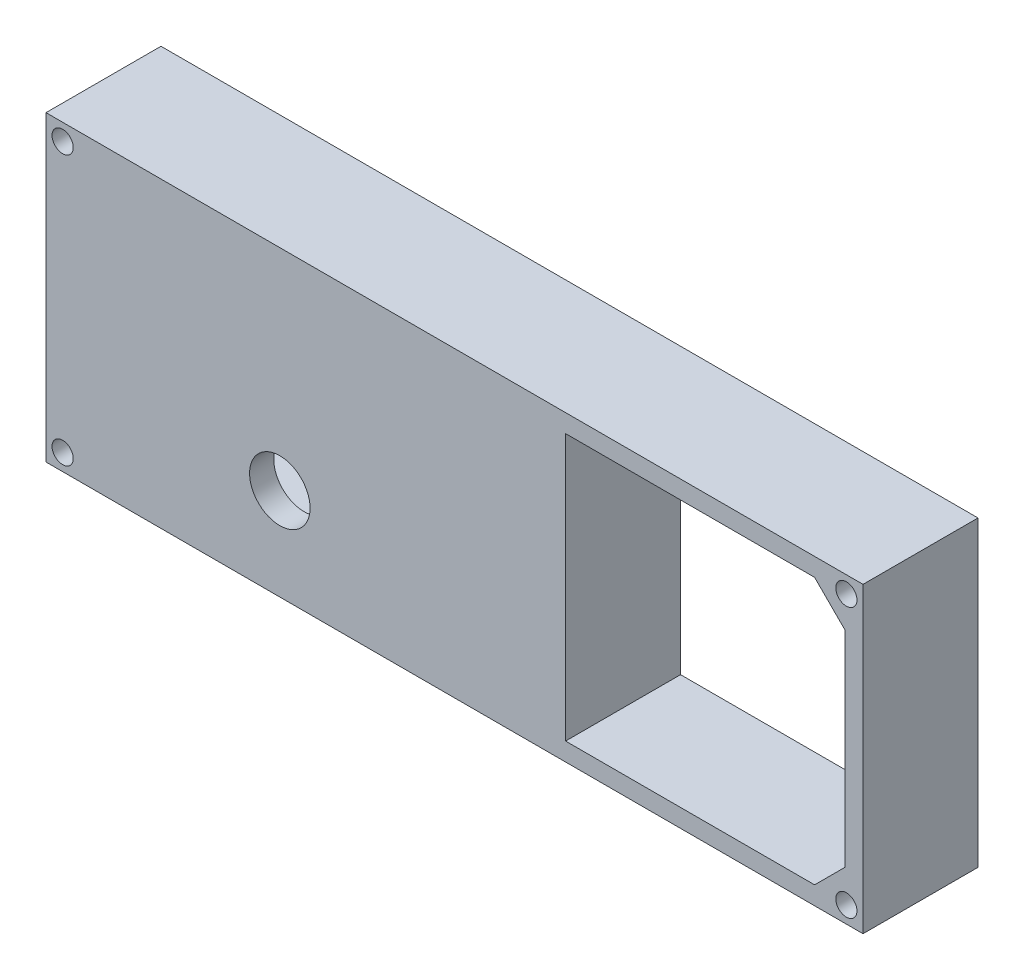
ISO-10303-21;
HEADER;
FILE_DESCRIPTION(('STEP AP214'),'2;1');
FILE_NAME('part.step','',(''),(''),'','','');
FILE_SCHEMA(('AUTOMOTIVE_DESIGN { 1 0 10303 214 1 1 1 1 }'));
ENDSEC;
DATA;
#1=APPLICATION_CONTEXT('core data for automotive mechanical design processes');
#2=APPLICATION_PROTOCOL_DEFINITION('international standard','automotive_design',2000,#1);
#3=PRODUCT_CONTEXT('',#1,'mechanical');
#4=PRODUCT('Part','Part','',(#3));
#5=PRODUCT_RELATED_PRODUCT_CATEGORY('part','',(#4));
#6=PRODUCT_DEFINITION_FORMATION('','',#4);
#7=PRODUCT_DEFINITION_CONTEXT('part definition',#1,'design');
#8=PRODUCT_DEFINITION('design','',#6,#7);
#9=PRODUCT_DEFINITION_SHAPE('','',#8);
#10=(LENGTH_UNIT() NAMED_UNIT(*) SI_UNIT(.MILLI.,.METRE.));
#11=(NAMED_UNIT(*) PLANE_ANGLE_UNIT() SI_UNIT($,.RADIAN.));
#12=(NAMED_UNIT(*) SI_UNIT($,.STERADIAN.) SOLID_ANGLE_UNIT());
#13=UNCERTAINTY_MEASURE_WITH_UNIT(LENGTH_MEASURE(1.E-05),#10,'distance_accuracy_value','');
#14=(GEOMETRIC_REPRESENTATION_CONTEXT(3) GLOBAL_UNCERTAINTY_ASSIGNED_CONTEXT((#13)) GLOBAL_UNIT_ASSIGNED_CONTEXT((#10,
#11,#12)) REPRESENTATION_CONTEXT('',''));
#15=CARTESIAN_POINT('',(0.,0.,0.));
#16=DIRECTION('',(0.,0.,1.));
#17=DIRECTION('',(1.,0.,0.));
#18=AXIS2_PLACEMENT_3D('',#15,#16,#17);
#19=CARTESIAN_POINT('',(-65.0123774263798,22.3613792313966,15.));
#20=DIRECTION('',(0.,0.,-1.));
#21=DIRECTION('',(-1.,0.,0.));
#22=AXIS2_PLACEMENT_3D('',#19,#20,#21);
#23=CYLINDRICAL_SURFACE('',#22,0.850000000000006);
#24=CARTESIAN_POINT('',(-65.0123774263798,22.3613792313966,0.));
#25=DIRECTION('',(0.,0.,1.));
#26=DIRECTION('',(1.,0.,0.));
#27=AXIS2_PLACEMENT_3D('',#24,#25,#26);
#28=CIRCLE('',#27,0.850000000000006);
#29=CARTESIAN_POINT('',(-64.1623774263798,22.3613792313966,0.));
#30=VERTEX_POINT('',#29);
#31=EDGE_CURVE('E211',#30,#30,#28,.T.);
#32=ORIENTED_EDGE('',*,*,#31,.F.);
#33=EDGE_LOOP('',(#32));
#34=FACE_BOUND('',#33,.T.);
#35=CARTESIAN_POINT('',(-65.0123774263798,22.3613792313966,7.));
#36=DIRECTION('',(0.,0.,1.));
#37=DIRECTION('',(1.,0.,0.));
#38=AXIS2_PLACEMENT_3D('',#35,#36,#37);
#39=CIRCLE('',#38,0.850000000000006);
#40=CARTESIAN_POINT('',(-64.1623774263798,22.3613792313966,7.));
#41=VERTEX_POINT('',#40);
#42=EDGE_CURVE('E37',#41,#41,#39,.T.);
#43=ORIENTED_EDGE('',*,*,#42,.T.);
#44=EDGE_LOOP('',(#43));
#45=FACE_BOUND('',#44,.T.);
#46=ADVANCED_FACE('F33',(#34,#45),#23,.F.);
#47=CARTESIAN_POINT('',(-65.0123774263798,-22.1386207686034,15.));
#48=DIRECTION('',(0.,0.,-1.));
#49=DIRECTION('',(-1.,0.,0.));
#50=AXIS2_PLACEMENT_3D('',#47,#48,#49);
#51=CYLINDRICAL_SURFACE('',#50,0.850000000000006);
#52=CARTESIAN_POINT('',(-65.0123774263798,-22.1386207686034,0.));
#53=DIRECTION('',(0.,0.,1.));
#54=DIRECTION('',(1.,0.,0.));
#55=AXIS2_PLACEMENT_3D('',#52,#53,#54);
#56=CIRCLE('',#55,0.850000000000006);
#57=CARTESIAN_POINT('',(-64.1623774263798,-22.1386207686034,0.));
#58=VERTEX_POINT('',#57);
#59=EDGE_CURVE('E208',#58,#58,#56,.T.);
#60=ORIENTED_EDGE('',*,*,#59,.F.);
#61=EDGE_LOOP('',(#60));
#62=FACE_BOUND('',#61,.T.);
#63=CARTESIAN_POINT('',(-65.0123774263798,-22.1386207686034,7.));
#64=DIRECTION('',(0.,0.,1.));
#65=DIRECTION('',(1.,0.,0.));
#66=AXIS2_PLACEMENT_3D('',#63,#64,#65);
#67=CIRCLE('',#66,0.850000000000006);
#68=CARTESIAN_POINT('',(-64.1623774263798,-22.1386207686034,7.));
#69=VERTEX_POINT('',#68);
#70=EDGE_CURVE('E305',#69,#69,#67,.T.);
#71=ORIENTED_EDGE('',*,*,#70,.T.);
#72=EDGE_LOOP('',(#71));
#73=FACE_BOUND('',#72,.T.);
#74=ADVANCED_FACE('F384',(#62,#73),#51,.F.);
#75=CARTESIAN_POINT('',(64.4876225736202,-22.1386207686034,15.));
#76=DIRECTION('',(0.,0.,-1.));
#77=DIRECTION('',(-1.,0.,0.));
#78=AXIS2_PLACEMENT_3D('',#75,#76,#77);
#79=CYLINDRICAL_SURFACE('',#78,0.850000000000006);
#80=CARTESIAN_POINT('',(64.4876225736202,-22.1386207686034,0.));
#81=DIRECTION('',(0.,0.,1.));
#82=DIRECTION('',(1.,0.,0.));
#83=AXIS2_PLACEMENT_3D('',#80,#81,#82);
#84=CIRCLE('',#83,0.850000000000006);
#85=CARTESIAN_POINT('',(65.3376225736202,-22.1386207686034,0.));
#86=VERTEX_POINT('',#85);
#87=EDGE_CURVE('E205',#86,#86,#84,.T.);
#88=ORIENTED_EDGE('',*,*,#87,.F.);
#89=EDGE_LOOP('',(#88));
#90=FACE_BOUND('',#89,.T.);
#91=CARTESIAN_POINT('',(64.4876225736202,-22.1386207686034,7.));
#92=DIRECTION('',(0.,0.,1.));
#93=DIRECTION('',(1.,0.,0.));
#94=AXIS2_PLACEMENT_3D('',#91,#92,#93);
#95=CIRCLE('',#94,0.850000000000006);
#96=CARTESIAN_POINT('',(65.3376225736202,-22.1386207686034,7.));
#97=VERTEX_POINT('',#96);
#98=EDGE_CURVE('E302',#97,#97,#95,.T.);
#99=ORIENTED_EDGE('',*,*,#98,.T.);
#100=EDGE_LOOP('',(#99));
#101=FACE_BOUND('',#100,.T.);
#102=ADVANCED_FACE('F390',(#90,#101),#79,.F.);
#103=CARTESIAN_POINT('',(64.4876225736202,22.3613792313966,15.));
#104=DIRECTION('',(0.,0.,-1.));
#105=DIRECTION('',(-1.,0.,0.));
#106=AXIS2_PLACEMENT_3D('',#103,#104,#105);
#107=CYLINDRICAL_SURFACE('',#106,0.850000000000006);
#108=CARTESIAN_POINT('',(64.4876225736202,22.3613792313966,0.));
#109=DIRECTION('',(0.,0.,1.));
#110=DIRECTION('',(1.,0.,0.));
#111=AXIS2_PLACEMENT_3D('',#108,#109,#110);
#112=CIRCLE('',#111,0.850000000000006);
#113=CARTESIAN_POINT('',(65.3376225736202,22.3613792313966,0.));
#114=VERTEX_POINT('',#113);
#115=EDGE_CURVE('E202',#114,#114,#112,.T.);
#116=ORIENTED_EDGE('',*,*,#115,.F.);
#117=EDGE_LOOP('',(#116));
#118=FACE_BOUND('',#117,.T.);
#119=CARTESIAN_POINT('',(64.4876225736202,22.3613792313966,7.));
#120=DIRECTION('',(0.,0.,1.));
#121=DIRECTION('',(1.,0.,0.));
#122=AXIS2_PLACEMENT_3D('',#119,#120,#121);
#123=CIRCLE('',#122,0.850000000000006);
#124=CARTESIAN_POINT('',(65.3376225736202,22.3613792313966,7.));
#125=VERTEX_POINT('',#124);
#126=EDGE_CURVE('E299',#125,#125,#123,.T.);
#127=ORIENTED_EDGE('',*,*,#126,.T.);
#128=EDGE_LOOP('',(#127));
#129=FACE_BOUND('',#128,.T.);
#130=ADVANCED_FACE('F442',(#118,#129),#107,.F.);
#131=CARTESIAN_POINT('',(0.,0.,0.));
#132=DIRECTION('',(0.,0.,1.));
#133=DIRECTION('',(1.,0.,0.));
#134=AXIS2_PLACEMENT_3D('',#131,#132,#133);
#135=PLANE('',#134);
#136=DIRECTION('',(0.707106781186547,-0.707106781186548,0.));
#137=VECTOR('',#136,1.);
#138=CARTESIAN_POINT('',(-64.7623774263798,-16.8886207686034,0.));
#139=LINE('',#138,#137);
#140=CARTESIAN_POINT('',(-64.7623774263798,-16.8886207686034,0.));
#141=VERTEX_POINT('',#140);
#142=CARTESIAN_POINT('',(-59.7623774263798,-21.8886207686034,0.));
#143=VERTEX_POINT('',#142);
#144=EDGE_CURVE('E58',#141,#143,#139,.T.);
#145=ORIENTED_EDGE('',*,*,#144,.T.);
#146=DIRECTION('',(1.,0.,0.));
#147=VECTOR('',#146,1.);
#148=CARTESIAN_POINT('',(-59.7623774263798,-21.8886207686034,0.));
#149=LINE('',#148,#147);
#150=CARTESIAN_POINT('',(15.0892665911631,-21.8886207686034,0.));
#151=VERTEX_POINT('',#150);
#152=EDGE_CURVE('E257',#143,#151,#149,.T.);
#153=ORIENTED_EDGE('',*,*,#152,.T.);
#154=DIRECTION('',(0.,1.,0.));
#155=VECTOR('',#154,1.);
#156=CARTESIAN_POINT('',(15.0892665911631,22.1113792313966,0.));
#157=LINE('',#156,#155);
#158=CARTESIAN_POINT('',(15.0892665911631,22.1113792313966,0.));
#159=VERTEX_POINT('',#158);
#160=EDGE_CURVE('E260',#151,#159,#157,.T.);
#161=ORIENTED_EDGE('',*,*,#160,.T.);
#162=DIRECTION('',(-1.,0.,0.));
#163=VECTOR('',#162,1.);
#164=CARTESIAN_POINT('',(-59.7623774263798,22.1113792313966,0.));
#165=LINE('',#164,#163);
#166=CARTESIAN_POINT('',(-59.7623774263798,22.1113792313966,0.));
#167=VERTEX_POINT('',#166);
#168=EDGE_CURVE('E263',#159,#167,#165,.T.);
#169=ORIENTED_EDGE('',*,*,#168,.T.);
#170=DIRECTION('',(-0.707106781186547,-0.707106781186548,0.));
#171=VECTOR('',#170,1.);
#172=CARTESIAN_POINT('',(-59.7623774263798,22.1113792313966,0.));
#173=LINE('',#172,#171);
#174=CARTESIAN_POINT('',(-64.7623774263798,17.1113792313966,0.));
#175=VERTEX_POINT('',#174);
#176=EDGE_CURVE('E266',#167,#175,#173,.T.);
#177=ORIENTED_EDGE('',*,*,#176,.T.);
#178=DIRECTION('',(0.,-1.,0.));
#179=VECTOR('',#178,1.);
#180=CARTESIAN_POINT('',(-64.7623774263798,17.1113792313966,0.));
#181=LINE('',#180,#179);
#182=EDGE_CURVE('E240',#175,#141,#181,.T.);
#183=ORIENTED_EDGE('',*,*,#182,.T.);
#184=EDGE_LOOP('',(#145,#153,#161,#169,#177,#183));
#185=FACE_BOUND('',#184,.T.);
#186=DIRECTION('',(-1.,0.,0.));
#187=VECTOR('',#186,1.);
#188=CARTESIAN_POINT('',(67.2376225736202,25.1113792313966,0.));
#189=LINE('',#188,#187);
#190=CARTESIAN_POINT('',(67.2376225736202,25.1113792313966,0.));
#191=VERTEX_POINT('',#190);
#192=CARTESIAN_POINT('',(-67.7623774263798,25.1113792313966,0.));
#193=VERTEX_POINT('',#192);
#194=EDGE_CURVE('E282',#191,#193,#189,.T.);
#195=ORIENTED_EDGE('',*,*,#194,.F.);
#196=DIRECTION('',(0.,1.,0.));
#197=VECTOR('',#196,1.);
#198=CARTESIAN_POINT('',(67.2376225736202,-24.8886207686034,0.));
#199=LINE('',#198,#197);
#200=CARTESIAN_POINT('',(67.2376225736202,-24.8886207686034,0.));
#201=VERTEX_POINT('',#200);
#202=EDGE_CURVE('E289',#201,#191,#199,.T.);
#203=ORIENTED_EDGE('',*,*,#202,.F.);
#204=DIRECTION('',(1.,0.,0.));
#205=VECTOR('',#204,1.);
#206=CARTESIAN_POINT('',(-67.7623774263798,-24.8886207686034,0.));
#207=LINE('',#206,#205);
#208=CARTESIAN_POINT('',(-67.7623774263798,-24.8886207686034,0.));
#209=VERTEX_POINT('',#208);
#210=EDGE_CURVE('E287',#209,#201,#207,.T.);
#211=ORIENTED_EDGE('',*,*,#210,.F.);
#212=DIRECTION('',(0.,-1.,0.));
#213=VECTOR('',#212,1.);
#214=CARTESIAN_POINT('',(-67.7623774263798,25.1113792313966,0.));
#215=LINE('',#214,#213);
#216=EDGE_CURVE('E285',#193,#209,#215,.T.);
#217=ORIENTED_EDGE('',*,*,#216,.F.);
#218=EDGE_LOOP('',(#195,#203,#211,#217));
#219=FACE_BOUND('',#218,.T.);
#220=DIRECTION('',(-1.,0.,0.));
#221=VECTOR('',#220,1.);
#222=CARTESIAN_POINT('',(59.2376225736202,22.1113792313966,0.));
#223=LINE('',#222,#221);
#224=CARTESIAN_POINT('',(59.2376225736202,22.1113792313966,0.));
#225=VERTEX_POINT('',#224);
#226=CARTESIAN_POINT('',(18.0892665911631,22.1113792313966,0.));
#227=VERTEX_POINT('',#226);
#228=EDGE_CURVE('E50',#225,#227,#223,.T.);
#229=ORIENTED_EDGE('',*,*,#228,.T.);
#230=DIRECTION('',(0.,-1.,0.));
#231=VECTOR('',#230,1.);
#232=CARTESIAN_POINT('',(18.0892665911631,22.1113792313966,0.));
#233=LINE('',#232,#231);
#234=CARTESIAN_POINT('',(18.0892665911631,-21.8886207686034,0.));
#235=VERTEX_POINT('',#234);
#236=EDGE_CURVE('E157',#227,#235,#233,.T.);
#237=ORIENTED_EDGE('',*,*,#236,.T.);
#238=DIRECTION('',(1.,0.,0.));
#239=VECTOR('',#238,1.);
#240=CARTESIAN_POINT('',(18.0892665911631,-21.8886207686034,0.));
#241=LINE('',#240,#239);
#242=CARTESIAN_POINT('',(59.2376225736202,-21.8886207686034,0.));
#243=VERTEX_POINT('',#242);
#244=EDGE_CURVE('E216',#235,#243,#241,.T.);
#245=ORIENTED_EDGE('',*,*,#244,.T.);
#246=DIRECTION('',(0.707106781186547,0.707106781186548,0.));
#247=VECTOR('',#246,1.);
#248=CARTESIAN_POINT('',(59.2376225736202,-21.8886207686034,0.));
#249=LINE('',#248,#247);
#250=CARTESIAN_POINT('',(64.2376225736202,-16.8886207686034,0.));
#251=VERTEX_POINT('',#250);
#252=EDGE_CURVE('E219',#243,#251,#249,.T.);
#253=ORIENTED_EDGE('',*,*,#252,.T.);
#254=DIRECTION('',(0.,1.,0.));
#255=VECTOR('',#254,1.);
#256=CARTESIAN_POINT('',(64.2376225736202,-16.8886207686034,0.));
#257=LINE('',#256,#255);
#258=CARTESIAN_POINT('',(64.2376225736202,17.1113792313966,0.));
#259=VERTEX_POINT('',#258);
#260=EDGE_CURVE('E222',#251,#259,#257,.T.);
#261=ORIENTED_EDGE('',*,*,#260,.T.);
#262=DIRECTION('',(-0.707106781186547,0.707106781186548,0.));
#263=VECTOR('',#262,1.);
#264=CARTESIAN_POINT('',(64.2376225736202,17.1113792313966,0.));
#265=LINE('',#264,#263);
#266=EDGE_CURVE('E225',#259,#225,#265,.T.);
#267=ORIENTED_EDGE('',*,*,#266,.T.);
#268=EDGE_LOOP('',(#229,#237,#245,#253,#261,#267));
#269=FACE_BOUND('',#268,.T.);
#270=ORIENTED_EDGE('',*,*,#31,.T.);
#271=EDGE_LOOP('',(#270));
#272=FACE_BOUND('',#271,.T.);
#273=ORIENTED_EDGE('',*,*,#59,.T.);
#274=EDGE_LOOP('',(#273));
#275=FACE_BOUND('',#274,.T.);
#276=ORIENTED_EDGE('',*,*,#87,.T.);
#277=EDGE_LOOP('',(#276));
#278=FACE_BOUND('',#277,.T.);
#279=ORIENTED_EDGE('',*,*,#115,.T.);
#280=EDGE_LOOP('',(#279));
#281=FACE_BOUND('',#280,.T.);
#282=ADVANCED_FACE('F439',(#185,#219,#269,#272,#275,#278,#281),#135,.F.);
#283=CARTESIAN_POINT('',(67.2376225736202,25.1113792313966,15.));
#284=DIRECTION('',(0.,-1.,0.));
#285=DIRECTION('',(0.,0.,-1.));
#286=AXIS2_PLACEMENT_3D('',#283,#284,#285);
#287=PLANE('',#286);
#288=ORIENTED_EDGE('',*,*,#194,.T.);
#289=DIRECTION('',(0.,0.,-1.));
#290=VECTOR('',#289,1.);
#291=CARTESIAN_POINT('',(-67.7623774263798,25.1113792313966,15.));
#292=LINE('',#291,#290);
#293=CARTESIAN_POINT('',(-67.7623774263798,25.1113792313966,19.));
#294=VERTEX_POINT('',#293);
#295=EDGE_CURVE('E11',#294,#193,#292,.T.);
#296=ORIENTED_EDGE('',*,*,#295,.F.);
#297=DIRECTION('',(-1.,0.,0.));
#298=VECTOR('',#297,1.);
#299=CARTESIAN_POINT('',(-67.7623774263798,25.1113792313966,19.));
#300=LINE('',#299,#298);
#301=CARTESIAN_POINT('',(67.2376225736202,25.1113792313966,19.));
#302=VERTEX_POINT('',#301);
#303=EDGE_CURVE('E199',#302,#294,#300,.T.);
#304=ORIENTED_EDGE('',*,*,#303,.F.);
#305=DIRECTION('',(0.,0.,-1.));
#306=VECTOR('',#305,1.);
#307=CARTESIAN_POINT('',(67.2376225736202,25.1113792313966,15.));
#308=LINE('',#307,#306);
#309=EDGE_CURVE('E291',#302,#191,#308,.T.);
#310=ORIENTED_EDGE('',*,*,#309,.T.);
#311=EDGE_LOOP('',(#288,#296,#304,#310));
#312=FACE_BOUND('',#311,.T.);
#313=ADVANCED_FACE('F35',(#312),#287,.F.);
#314=CARTESIAN_POINT('',(-67.7623774263798,25.1113792313966,15.));
#315=DIRECTION('',(1.,0.,0.));
#316=DIRECTION('',(0.,0.,-1.));
#317=AXIS2_PLACEMENT_3D('',#314,#315,#316);
#318=PLANE('',#317);
#319=ORIENTED_EDGE('',*,*,#216,.T.);
#320=DIRECTION('',(0.,0.,-1.));
#321=VECTOR('',#320,1.);
#322=CARTESIAN_POINT('',(-67.7623774263798,-24.8886207686034,15.));
#323=LINE('',#322,#321);
#324=CARTESIAN_POINT('',(-67.7623774263798,-24.8886207686034,19.));
#325=VERTEX_POINT('',#324);
#326=EDGE_CURVE('E42',#325,#209,#323,.T.);
#327=ORIENTED_EDGE('',*,*,#326,.F.);
#328=DIRECTION('',(0.,-1.,0.));
#329=VECTOR('',#328,1.);
#330=CARTESIAN_POINT('',(-67.7623774263798,25.1113792313966,19.));
#331=LINE('',#330,#329);
#332=EDGE_CURVE('E188',#294,#325,#331,.T.);
#333=ORIENTED_EDGE('',*,*,#332,.F.);
#334=ORIENTED_EDGE('',*,*,#295,.T.);
#335=EDGE_LOOP('',(#319,#327,#333,#334));
#336=FACE_BOUND('',#335,.T.);
#337=ADVANCED_FACE('F449',(#336),#318,.F.);
#338=CARTESIAN_POINT('',(-67.7623774263798,-24.8886207686034,15.));
#339=DIRECTION('',(0.,1.,0.));
#340=DIRECTION('',(0.,0.,1.));
#341=AXIS2_PLACEMENT_3D('',#338,#339,#340);
#342=PLANE('',#341);
#343=ORIENTED_EDGE('',*,*,#210,.T.);
#344=DIRECTION('',(0.,0.,-1.));
#345=VECTOR('',#344,1.);
#346=CARTESIAN_POINT('',(67.2376225736202,-24.8886207686034,15.));
#347=LINE('',#346,#345);
#348=CARTESIAN_POINT('',(67.2376225736202,-24.8886207686034,19.));
#349=VERTEX_POINT('',#348);
#350=EDGE_CURVE('E294',#349,#201,#347,.T.);
#351=ORIENTED_EDGE('',*,*,#350,.F.);
#352=DIRECTION('',(1.,0.,0.));
#353=VECTOR('',#352,1.);
#354=CARTESIAN_POINT('',(-67.7623774263798,-24.8886207686034,19.));
#355=LINE('',#354,#353);
#356=EDGE_CURVE('E193',#325,#349,#355,.T.);
#357=ORIENTED_EDGE('',*,*,#356,.F.);
#358=ORIENTED_EDGE('',*,*,#326,.T.);
#359=EDGE_LOOP('',(#343,#351,#357,#358));
#360=FACE_BOUND('',#359,.T.);
#361=ADVANCED_FACE('F446',(#360),#342,.F.);
#362=CARTESIAN_POINT('',(67.2376225736202,-24.8886207686034,15.));
#363=DIRECTION('',(-1.,0.,0.));
#364=DIRECTION('',(0.,0.,1.));
#365=AXIS2_PLACEMENT_3D('',#362,#363,#364);
#366=PLANE('',#365);
#367=ORIENTED_EDGE('',*,*,#202,.T.);
#368=ORIENTED_EDGE('',*,*,#309,.F.);
#369=DIRECTION('',(0.,1.,0.));
#370=VECTOR('',#369,1.);
#371=CARTESIAN_POINT('',(67.2376225736202,25.1113792313966,19.));
#372=LINE('',#371,#370);
#373=EDGE_CURVE('E196',#349,#302,#372,.T.);
#374=ORIENTED_EDGE('',*,*,#373,.F.);
#375=ORIENTED_EDGE('',*,*,#350,.T.);
#376=EDGE_LOOP('',(#367,#368,#374,#375));
#377=FACE_BOUND('',#376,.T.);
#378=ADVANCED_FACE('F438',(#377),#366,.F.);
#379=CARTESIAN_POINT('',(-64.7623774263798,-16.8886207686034,15.));
#380=DIRECTION('',(0.707106781186548,0.707106781186547,0.));
#381=DIRECTION('',(-0.707106781186547,0.707106781186548,0.));
#382=AXIS2_PLACEMENT_3D('',#379,#380,#381);
#383=PLANE('',#382);
#384=ORIENTED_EDGE('',*,*,#144,.F.);
#385=DIRECTION('',(0.,0.,-1.));
#386=VECTOR('',#385,1.);
#387=CARTESIAN_POINT('',(-64.7623774263798,-16.8886207686034,15.));
#388=LINE('',#387,#386);
#389=CARTESIAN_POINT('',(-64.7623774263798,-16.8886207686034,15.));
#390=VERTEX_POINT('',#389);
#391=EDGE_CURVE('E255',#390,#141,#388,.T.);
#392=ORIENTED_EDGE('',*,*,#391,.F.);
#393=DIRECTION('',(0.707106781186547,-0.707106781186548,0.));
#394=VECTOR('',#393,1.);
#395=CARTESIAN_POINT('',(-64.7623774263798,-16.8886207686034,15.));
#396=LINE('',#395,#394);
#397=CARTESIAN_POINT('',(-59.7623774263798,-21.8886207686034,15.));
#398=VERTEX_POINT('',#397);
#399=EDGE_CURVE('E236',#390,#398,#396,.T.);
#400=ORIENTED_EDGE('',*,*,#399,.T.);
#401=DIRECTION('',(0.,0.,-1.));
#402=VECTOR('',#401,1.);
#403=CARTESIAN_POINT('',(-59.7623774263798,-21.8886207686034,15.));
#404=LINE('',#403,#402);
#405=EDGE_CURVE('E280',#398,#143,#404,.T.);
#406=ORIENTED_EDGE('',*,*,#405,.T.);
#407=EDGE_LOOP('',(#384,#392,#400,#406));
#408=FACE_BOUND('',#407,.T.);
#409=ADVANCED_FACE('F434',(#408),#383,.T.);
#410=CARTESIAN_POINT('',(-59.7623774263798,-21.8886207686034,15.));
#411=DIRECTION('',(0.,1.,0.));
#412=DIRECTION('',(-1.,0.,0.));
#413=AXIS2_PLACEMENT_3D('',#410,#411,#412);
#414=PLANE('',#413);
#415=ORIENTED_EDGE('',*,*,#152,.F.);
#416=ORIENTED_EDGE('',*,*,#405,.F.);
#417=DIRECTION('',(1.,0.,0.));
#418=VECTOR('',#417,1.);
#419=CARTESIAN_POINT('',(-59.7623774263798,-21.8886207686034,15.));
#420=LINE('',#419,#418);
#421=CARTESIAN_POINT('',(15.0892665911631,-21.8886207686034,15.));
#422=VERTEX_POINT('',#421);
#423=EDGE_CURVE('E239',#398,#422,#420,.T.);
#424=ORIENTED_EDGE('',*,*,#423,.T.);
#425=DIRECTION('',(0.,0.,-1.));
#426=VECTOR('',#425,1.);
#427=CARTESIAN_POINT('',(15.0892665911631,-21.8886207686034,15.));
#428=LINE('',#427,#426);
#429=EDGE_CURVE('E278',#422,#151,#428,.T.);
#430=ORIENTED_EDGE('',*,*,#429,.T.);
#431=EDGE_LOOP('',(#415,#416,#424,#430));
#432=FACE_BOUND('',#431,.T.);
#433=ADVANCED_FACE('F430',(#432),#414,.T.);
#434=CARTESIAN_POINT('',(15.0892665911631,22.1113792313966,15.));
#435=DIRECTION('',(-1.,0.,0.));
#436=DIRECTION('',(0.,-1.,0.));
#437=AXIS2_PLACEMENT_3D('',#434,#435,#436);
#438=PLANE('',#437);
#439=ORIENTED_EDGE('',*,*,#160,.F.);
#440=ORIENTED_EDGE('',*,*,#429,.F.);
#441=DIRECTION('',(0.,1.,0.));
#442=VECTOR('',#441,1.);
#443=CARTESIAN_POINT('',(15.0892665911631,22.1113792313966,15.));
#444=LINE('',#443,#442);
#445=CARTESIAN_POINT('',(15.0892665911631,22.1113792313966,15.));
#446=VERTEX_POINT('',#445);
#447=EDGE_CURVE('E243',#422,#446,#444,.T.);
#448=ORIENTED_EDGE('',*,*,#447,.T.);
#449=DIRECTION('',(0.,0.,-1.));
#450=VECTOR('',#449,1.);
#451=CARTESIAN_POINT('',(15.0892665911631,22.1113792313966,15.));
#452=LINE('',#451,#450);
#453=EDGE_CURVE('E276',#446,#159,#452,.T.);
#454=ORIENTED_EDGE('',*,*,#453,.T.);
#455=EDGE_LOOP('',(#439,#440,#448,#454));
#456=FACE_BOUND('',#455,.T.);
#457=ADVANCED_FACE('F426',(#456),#438,.T.);
#458=CARTESIAN_POINT('',(-59.7623774263798,22.1113792313966,15.));
#459=DIRECTION('',(0.,-1.,0.));
#460=DIRECTION('',(1.,0.,0.));
#461=AXIS2_PLACEMENT_3D('',#458,#459,#460);
#462=PLANE('',#461);
#463=ORIENTED_EDGE('',*,*,#168,.F.);
#464=ORIENTED_EDGE('',*,*,#453,.F.);
#465=DIRECTION('',(-1.,0.,0.));
#466=VECTOR('',#465,1.);
#467=CARTESIAN_POINT('',(-59.7623774263798,22.1113792313966,15.));
#468=LINE('',#467,#466);
#469=CARTESIAN_POINT('',(-59.7623774263798,22.1113792313966,15.));
#470=VERTEX_POINT('',#469);
#471=EDGE_CURVE('E246',#446,#470,#468,.T.);
#472=ORIENTED_EDGE('',*,*,#471,.T.);
#473=DIRECTION('',(0.,0.,-1.));
#474=VECTOR('',#473,1.);
#475=CARTESIAN_POINT('',(-59.7623774263798,22.1113792313966,15.));
#476=LINE('',#475,#474);
#477=EDGE_CURVE('E274',#470,#167,#476,.T.);
#478=ORIENTED_EDGE('',*,*,#477,.T.);
#479=EDGE_LOOP('',(#463,#464,#472,#478));
#480=FACE_BOUND('',#479,.T.);
#481=ADVANCED_FACE('F422',(#480),#462,.T.);
#482=CARTESIAN_POINT('',(-59.7623774263798,22.1113792313966,15.));
#483=DIRECTION('',(0.707106781186548,-0.707106781186547,0.));
#484=DIRECTION('',(0.707106781186547,0.707106781186548,0.));
#485=AXIS2_PLACEMENT_3D('',#482,#483,#484);
#486=PLANE('',#485);
#487=ORIENTED_EDGE('',*,*,#176,.F.);
#488=ORIENTED_EDGE('',*,*,#477,.F.);
#489=DIRECTION('',(-0.707106781186547,-0.707106781186548,0.));
#490=VECTOR('',#489,1.);
#491=CARTESIAN_POINT('',(-59.7623774263798,22.1113792313966,15.));
#492=LINE('',#491,#490);
#493=CARTESIAN_POINT('',(-64.7623774263798,17.1113792313966,15.));
#494=VERTEX_POINT('',#493);
#495=EDGE_CURVE('E249',#470,#494,#492,.T.);
#496=ORIENTED_EDGE('',*,*,#495,.T.);
#497=DIRECTION('',(0.,0.,-1.));
#498=VECTOR('',#497,1.);
#499=CARTESIAN_POINT('',(-64.7623774263798,17.1113792313966,15.));
#500=LINE('',#499,#498);
#501=EDGE_CURVE('E272',#494,#175,#500,.T.);
#502=ORIENTED_EDGE('',*,*,#501,.T.);
#503=EDGE_LOOP('',(#487,#488,#496,#502));
#504=FACE_BOUND('',#503,.T.);
#505=ADVANCED_FACE('F418',(#504),#486,.T.);
#506=CARTESIAN_POINT('',(-64.7623774263798,17.1113792313966,15.));
#507=DIRECTION('',(1.,0.,0.));
#508=DIRECTION('',(0.,0.,-1.));
#509=AXIS2_PLACEMENT_3D('',#506,#507,#508);
#510=PLANE('',#509);
#511=ORIENTED_EDGE('',*,*,#182,.F.);
#512=ORIENTED_EDGE('',*,*,#501,.F.);
#513=DIRECTION('',(0.,-1.,0.));
#514=VECTOR('',#513,1.);
#515=CARTESIAN_POINT('',(-64.7623774263798,17.1113792313966,15.));
#516=LINE('',#515,#514);
#517=EDGE_CURVE('E252',#494,#390,#516,.T.);
#518=ORIENTED_EDGE('',*,*,#517,.T.);
#519=ORIENTED_EDGE('',*,*,#391,.T.);
#520=EDGE_LOOP('',(#511,#512,#518,#519));
#521=FACE_BOUND('',#520,.T.);
#522=ADVANCED_FACE('F415',(#521),#510,.T.);
#523=CARTESIAN_POINT('',(59.2376225736202,22.1113792313966,15.));
#524=DIRECTION('',(0.,-1.,0.));
#525=DIRECTION('',(1.,0.,0.));
#526=AXIS2_PLACEMENT_3D('',#523,#524,#525);
#527=PLANE('',#526);
#528=ORIENTED_EDGE('',*,*,#228,.F.);
#529=DIRECTION('',(0.,0.,-1.));
#530=VECTOR('',#529,1.);
#531=CARTESIAN_POINT('',(59.2376225736202,22.1113792313966,15.));
#532=LINE('',#531,#530);
#533=CARTESIAN_POINT('',(59.2376225736202,22.1113792313966,19.));
#534=VERTEX_POINT('',#533);
#535=EDGE_CURVE('E163',#534,#225,#532,.T.);
#536=ORIENTED_EDGE('',*,*,#535,.F.);
#537=DIRECTION('',(-1.,0.,0.));
#538=VECTOR('',#537,1.);
#539=CARTESIAN_POINT('',(59.2376225736202,22.1113792313966,19.));
#540=LINE('',#539,#538);
#541=CARTESIAN_POINT('',(18.0892665911631,22.1113792313966,19.));
#542=VERTEX_POINT('',#541);
#543=EDGE_CURVE('E161',#534,#542,#540,.T.);
#544=ORIENTED_EDGE('',*,*,#543,.T.);
#545=DIRECTION('',(0.,0.,-1.));
#546=VECTOR('',#545,1.);
#547=CARTESIAN_POINT('',(18.0892665911631,22.1113792313966,15.));
#548=LINE('',#547,#546);
#549=EDGE_CURVE('E150',#542,#227,#548,.T.);
#550=ORIENTED_EDGE('',*,*,#549,.T.);
#551=EDGE_LOOP('',(#528,#536,#544,#550));
#552=FACE_BOUND('',#551,.T.);
#553=ADVANCED_FACE('F162',(#552),#527,.T.);
#554=CARTESIAN_POINT('',(18.0892665911631,22.1113792313966,15.));
#555=DIRECTION('',(1.,0.,0.));
#556=DIRECTION('',(0.,0.,-1.));
#557=AXIS2_PLACEMENT_3D('',#554,#555,#556);
#558=PLANE('',#557);
#559=ORIENTED_EDGE('',*,*,#236,.F.);
#560=ORIENTED_EDGE('',*,*,#549,.F.);
#561=DIRECTION('',(0.,-1.,0.));
#562=VECTOR('',#561,1.);
#563=CARTESIAN_POINT('',(18.0892665911631,22.1113792313966,19.));
#564=LINE('',#563,#562);
#565=CARTESIAN_POINT('',(18.0892665911631,-21.8886207686034,19.));
#566=VERTEX_POINT('',#565);
#567=EDGE_CURVE('E154',#542,#566,#564,.T.);
#568=ORIENTED_EDGE('',*,*,#567,.T.);
#569=DIRECTION('',(0.,0.,-1.));
#570=VECTOR('',#569,1.);
#571=CARTESIAN_POINT('',(18.0892665911631,-21.8886207686034,15.));
#572=LINE('',#571,#570);
#573=EDGE_CURVE('E158',#566,#235,#572,.T.);
#574=ORIENTED_EDGE('',*,*,#573,.T.);
#575=EDGE_LOOP('',(#559,#560,#568,#574));
#576=FACE_BOUND('',#575,.T.);
#577=ADVANCED_FACE('F152',(#576),#558,.T.);
#578=CARTESIAN_POINT('',(18.0892665911631,-21.8886207686034,15.));
#579=DIRECTION('',(0.,1.,0.));
#580=DIRECTION('',(-1.,0.,0.));
#581=AXIS2_PLACEMENT_3D('',#578,#579,#580);
#582=PLANE('',#581);
#583=ORIENTED_EDGE('',*,*,#244,.F.);
#584=ORIENTED_EDGE('',*,*,#573,.F.);
#585=DIRECTION('',(1.,0.,0.));
#586=VECTOR('',#585,1.);
#587=CARTESIAN_POINT('',(18.0892665911631,-21.8886207686034,19.));
#588=LINE('',#587,#586);
#589=CARTESIAN_POINT('',(59.2376225736202,-21.8886207686034,19.));
#590=VERTEX_POINT('',#589);
#591=EDGE_CURVE('E171',#566,#590,#588,.T.);
#592=ORIENTED_EDGE('',*,*,#591,.T.);
#593=DIRECTION('',(0.,0.,-1.));
#594=VECTOR('',#593,1.);
#595=CARTESIAN_POINT('',(59.2376225736202,-21.8886207686034,15.));
#596=LINE('',#595,#594);
#597=EDGE_CURVE('E233',#590,#243,#596,.T.);
#598=ORIENTED_EDGE('',*,*,#597,.T.);
#599=EDGE_LOOP('',(#583,#584,#592,#598));
#600=FACE_BOUND('',#599,.T.);
#601=ADVANCED_FACE('F406',(#600),#582,.T.);
#602=CARTESIAN_POINT('',(59.2376225736202,-21.8886207686034,15.));
#603=DIRECTION('',(-0.707106781186548,0.707106781186547,0.));
#604=DIRECTION('',(-0.707106781186547,-0.707106781186548,0.));
#605=AXIS2_PLACEMENT_3D('',#602,#603,#604);
#606=PLANE('',#605);
#607=ORIENTED_EDGE('',*,*,#252,.F.);
#608=ORIENTED_EDGE('',*,*,#597,.F.);
#609=DIRECTION('',(0.707106781186547,0.707106781186548,0.));
#610=VECTOR('',#609,1.);
#611=CARTESIAN_POINT('',(59.2376225736202,-21.8886207686034,19.));
#612=LINE('',#611,#610);
#613=CARTESIAN_POINT('',(64.2376225736202,-16.8886207686034,19.));
#614=VERTEX_POINT('',#613);
#615=EDGE_CURVE('E173',#590,#614,#612,.T.);
#616=ORIENTED_EDGE('',*,*,#615,.T.);
#617=DIRECTION('',(0.,0.,-1.));
#618=VECTOR('',#617,1.);
#619=CARTESIAN_POINT('',(64.2376225736202,-16.8886207686034,15.));
#620=LINE('',#619,#618);
#621=EDGE_CURVE('E231',#614,#251,#620,.T.);
#622=ORIENTED_EDGE('',*,*,#621,.T.);
#623=EDGE_LOOP('',(#607,#608,#616,#622));
#624=FACE_BOUND('',#623,.T.);
#625=ADVANCED_FACE('F402',(#624),#606,.T.);
#626=CARTESIAN_POINT('',(64.2376225736202,-16.8886207686034,15.));
#627=DIRECTION('',(-1.,0.,0.));
#628=DIRECTION('',(0.,0.,1.));
#629=AXIS2_PLACEMENT_3D('',#626,#627,#628);
#630=PLANE('',#629);
#631=ORIENTED_EDGE('',*,*,#260,.F.);
#632=ORIENTED_EDGE('',*,*,#621,.F.);
#633=DIRECTION('',(0.,1.,0.));
#634=VECTOR('',#633,1.);
#635=CARTESIAN_POINT('',(64.2376225736202,-16.8886207686034,19.));
#636=LINE('',#635,#634);
#637=CARTESIAN_POINT('',(64.2376225736202,17.1113792313966,19.));
#638=VERTEX_POINT('',#637);
#639=EDGE_CURVE('E179',#614,#638,#636,.T.);
#640=ORIENTED_EDGE('',*,*,#639,.T.);
#641=DIRECTION('',(0.,0.,-1.));
#642=VECTOR('',#641,1.);
#643=CARTESIAN_POINT('',(64.2376225736202,17.1113792313966,15.));
#644=LINE('',#643,#642);
#645=EDGE_CURVE('E229',#638,#259,#644,.T.);
#646=ORIENTED_EDGE('',*,*,#645,.T.);
#647=EDGE_LOOP('',(#631,#632,#640,#646));
#648=FACE_BOUND('',#647,.T.);
#649=ADVANCED_FACE('F398',(#648),#630,.T.);
#650=CARTESIAN_POINT('',(64.2376225736202,17.1113792313966,15.));
#651=DIRECTION('',(-0.707106781186548,-0.707106781186547,0.));
#652=DIRECTION('',(0.707106781186547,-0.707106781186548,0.));
#653=AXIS2_PLACEMENT_3D('',#650,#651,#652);
#654=PLANE('',#653);
#655=ORIENTED_EDGE('',*,*,#266,.F.);
#656=ORIENTED_EDGE('',*,*,#645,.F.);
#657=DIRECTION('',(-0.707106781186548,0.707106781186547,0.));
#658=VECTOR('',#657,1.);
#659=CARTESIAN_POINT('',(64.2376225736202,17.1113792313966,19.));
#660=LINE('',#659,#658);
#661=EDGE_CURVE('E182',#638,#534,#660,.T.);
#662=ORIENTED_EDGE('',*,*,#661,.T.);
#663=ORIENTED_EDGE('',*,*,#535,.T.);
#664=EDGE_LOOP('',(#655,#656,#662,#663));
#665=FACE_BOUND('',#664,.T.);
#666=ADVANCED_FACE('F360',(#665),#654,.T.);
#667=CARTESIAN_POINT('',(0.,0.,19.));
#668=DIRECTION('',(0.,0.,1.));
#669=DIRECTION('',(1.,0.,0.));
#670=AXIS2_PLACEMENT_3D('',#667,#668,#669);
#671=PLANE('',#670);
#672=CARTESIAN_POINT('',(-65.0123774263798,22.3613792313966,19.));
#673=DIRECTION('',(0.,0.,1.));
#674=DIRECTION('',(1.,0.,0.));
#675=AXIS2_PLACEMENT_3D('',#672,#673,#674);
#676=CIRCLE('',#675,1.75);
#677=CARTESIAN_POINT('',(-63.2623774263798,22.3613792313966,19.));
#678=VERTEX_POINT('',#677);
#679=EDGE_CURVE('E323',#678,#678,#676,.T.);
#680=ORIENTED_EDGE('',*,*,#679,.F.);
#681=EDGE_LOOP('',(#680));
#682=FACE_BOUND('',#681,.T.);
#683=CARTESIAN_POINT('',(-65.0123774263798,-22.1386207686034,19.));
#684=DIRECTION('',(0.,0.,1.));
#685=DIRECTION('',(1.,0.,0.));
#686=AXIS2_PLACEMENT_3D('',#683,#684,#685);
#687=CIRCLE('',#686,1.75);
#688=CARTESIAN_POINT('',(-63.2623774263798,-22.1386207686034,19.));
#689=VERTEX_POINT('',#688);
#690=EDGE_CURVE('E322',#689,#689,#687,.T.);
#691=ORIENTED_EDGE('',*,*,#690,.F.);
#692=EDGE_LOOP('',(#691));
#693=FACE_BOUND('',#692,.T.);
#694=CARTESIAN_POINT('',(64.4876225736202,-22.1386207686034,19.));
#695=DIRECTION('',(0.,0.,1.));
#696=DIRECTION('',(1.,0.,0.));
#697=AXIS2_PLACEMENT_3D('',#694,#695,#696);
#698=CIRCLE('',#697,1.75);
#699=CARTESIAN_POINT('',(66.2376225736202,-22.1386207686034,19.));
#700=VERTEX_POINT('',#699);
#701=EDGE_CURVE('E339',#700,#700,#698,.T.);
#702=ORIENTED_EDGE('',*,*,#701,.F.);
#703=EDGE_LOOP('',(#702));
#704=FACE_BOUND('',#703,.T.);
#705=CARTESIAN_POINT('',(64.4876225736202,22.3613792313966,19.));
#706=DIRECTION('',(0.,0.,1.));
#707=DIRECTION('',(1.,0.,0.));
#708=AXIS2_PLACEMENT_3D('',#705,#706,#707);
#709=CIRCLE('',#708,1.75);
#710=CARTESIAN_POINT('',(66.2376225736202,22.3613792313966,19.));
#711=VERTEX_POINT('',#710);
#712=EDGE_CURVE('E333',#711,#711,#709,.T.);
#713=ORIENTED_EDGE('',*,*,#712,.F.);
#714=EDGE_LOOP('',(#713));
#715=FACE_BOUND('',#714,.T.);
#716=ORIENTED_EDGE('',*,*,#332,.T.);
#717=ORIENTED_EDGE('',*,*,#356,.T.);
#718=ORIENTED_EDGE('',*,*,#373,.T.);
#719=ORIENTED_EDGE('',*,*,#303,.T.);
#720=EDGE_LOOP('',(#716,#717,#718,#719));
#721=FACE_BOUND('',#720,.T.);
#722=CARTESIAN_POINT('',(-29.1269498285025,-9.66737545980051,19.));
#723=DIRECTION('',(0.,0.,1.));
#724=DIRECTION('',(1.,0.,0.));
#725=AXIS2_PLACEMENT_3D('',#722,#723,#724);
#726=CIRCLE('',#725,5.);
#727=CARTESIAN_POINT('',(-24.1269498285025,-9.66737545980051,19.));
#728=VERTEX_POINT('',#727);
#729=EDGE_CURVE('E185',#728,#728,#726,.T.);
#730=ORIENTED_EDGE('',*,*,#729,.F.);
#731=EDGE_LOOP('',(#730));
#732=FACE_BOUND('',#731,.T.);
#733=ORIENTED_EDGE('',*,*,#567,.F.);
#734=ORIENTED_EDGE('',*,*,#543,.F.);
#735=ORIENTED_EDGE('',*,*,#661,.F.);
#736=ORIENTED_EDGE('',*,*,#639,.F.);
#737=ORIENTED_EDGE('',*,*,#615,.F.);
#738=ORIENTED_EDGE('',*,*,#591,.F.);
#739=EDGE_LOOP('',(#733,#734,#735,#736,#737,#738));
#740=FACE_BOUND('',#739,.T.);
#741=ADVANCED_FACE('F168',(#682,#693,#704,#715,#721,#732,#740),#671,.T.);
#742=CARTESIAN_POINT('',(0.,0.,15.));
#743=DIRECTION('',(0.,0.,1.));
#744=DIRECTION('',(1.,0.,0.));
#745=AXIS2_PLACEMENT_3D('',#742,#743,#744);
#746=PLANE('',#745);
#747=ORIENTED_EDGE('',*,*,#423,.F.);
#748=ORIENTED_EDGE('',*,*,#399,.F.);
#749=ORIENTED_EDGE('',*,*,#517,.F.);
#750=ORIENTED_EDGE('',*,*,#495,.F.);
#751=ORIENTED_EDGE('',*,*,#471,.F.);
#752=ORIENTED_EDGE('',*,*,#447,.F.);
#753=EDGE_LOOP('',(#747,#748,#749,#750,#751,#752));
#754=FACE_BOUND('',#753,.T.);
#755=CARTESIAN_POINT('',(-29.1269498285025,-9.66737545980051,15.));
#756=DIRECTION('',(0.,0.,1.));
#757=DIRECTION('',(1.,0.,0.));
#758=AXIS2_PLACEMENT_3D('',#755,#756,#757);
#759=CIRCLE('',#758,5.);
#760=CARTESIAN_POINT('',(-24.1269498285025,-9.66737545980051,15.));
#761=VERTEX_POINT('',#760);
#762=EDGE_CURVE('E184',#761,#761,#759,.T.);
#763=ORIENTED_EDGE('',*,*,#762,.T.);
#764=EDGE_LOOP('',(#763));
#765=FACE_BOUND('',#764,.T.);
#766=ADVANCED_FACE('F359',(#754,#765),#746,.F.);
#767=CARTESIAN_POINT('',(-29.1269498285025,-9.66737545980051,19.));
#768=DIRECTION('',(0.,0.,-1.));
#769=DIRECTION('',(-1.,0.,0.));
#770=AXIS2_PLACEMENT_3D('',#767,#768,#769);
#771=CYLINDRICAL_SURFACE('',#770,5.);
#772=ORIENTED_EDGE('',*,*,#729,.T.);
#773=EDGE_LOOP('',(#772));
#774=FACE_BOUND('',#773,.T.);
#775=ORIENTED_EDGE('',*,*,#762,.F.);
#776=EDGE_LOOP('',(#775));
#777=FACE_BOUND('',#776,.T.);
#778=ADVANCED_FACE('F370',(#774,#777),#771,.F.);
#779=CARTESIAN_POINT('',(64.4876225736202,22.3613792313966,7.));
#780=DIRECTION('',(0.,0.,1.));
#781=DIRECTION('',(1.,0.,0.));
#782=AXIS2_PLACEMENT_3D('',#779,#780,#781);
#783=CYLINDRICAL_SURFACE('',#782,1.75);
#784=CARTESIAN_POINT('',(64.4876225736202,22.3613792313966,7.));
#785=DIRECTION('',(0.,0.,1.));
#786=DIRECTION('',(1.,0.,0.));
#787=AXIS2_PLACEMENT_3D('',#784,#785,#786);
#788=CIRCLE('',#787,1.75);
#789=CARTESIAN_POINT('',(66.2376225736202,22.3613792313966,7.));
#790=VERTEX_POINT('',#789);
#791=EDGE_CURVE('E303',#790,#790,#788,.T.);
#792=ORIENTED_EDGE('',*,*,#791,.F.);
#793=EDGE_LOOP('',(#792));
#794=FACE_BOUND('',#793,.T.);
#795=ORIENTED_EDGE('',*,*,#712,.T.);
#796=EDGE_LOOP('',(#795));
#797=FACE_BOUND('',#796,.T.);
#798=ADVANCED_FACE('F373',(#794,#797),#783,.F.);
#799=CARTESIAN_POINT('',(64.4876225736202,22.3613792313966,7.));
#800=DIRECTION('',(0.,0.,1.));
#801=DIRECTION('',(1.,0.,0.));
#802=AXIS2_PLACEMENT_3D('',#799,#800,#801);
#803=PLANE('',#802);
#804=ORIENTED_EDGE('',*,*,#126,.F.);
#805=EDGE_LOOP('',(#804));
#806=FACE_BOUND('',#805,.T.);
#807=ORIENTED_EDGE('',*,*,#791,.T.);
#808=EDGE_LOOP('',(#807));
#809=FACE_BOUND('',#808,.T.);
#810=ADVANCED_FACE('F477',(#806,#809),#803,.T.);
#811=CARTESIAN_POINT('',(64.4876225736202,-22.1386207686034,7.));
#812=DIRECTION('',(0.,0.,1.));
#813=DIRECTION('',(1.,0.,0.));
#814=AXIS2_PLACEMENT_3D('',#811,#812,#813);
#815=CYLINDRICAL_SURFACE('',#814,1.75);
#816=CARTESIAN_POINT('',(64.4876225736202,-22.1386207686034,7.));
#817=DIRECTION('',(0.,0.,1.));
#818=DIRECTION('',(1.,0.,0.));
#819=AXIS2_PLACEMENT_3D('',#816,#817,#818);
#820=CIRCLE('',#819,1.75);
#821=CARTESIAN_POINT('',(66.2376225736202,-22.1386207686034,7.));
#822=VERTEX_POINT('',#821);
#823=EDGE_CURVE('E335',#822,#822,#820,.T.);
#824=ORIENTED_EDGE('',*,*,#823,.F.);
#825=EDGE_LOOP('',(#824));
#826=FACE_BOUND('',#825,.T.);
#827=ORIENTED_EDGE('',*,*,#701,.T.);
#828=EDGE_LOOP('',(#827));
#829=FACE_BOUND('',#828,.T.);
#830=ADVANCED_FACE('F480',(#826,#829),#815,.F.);
#831=CARTESIAN_POINT('',(64.4876225736202,-22.1386207686034,7.));
#832=DIRECTION('',(0.,0.,1.));
#833=DIRECTION('',(1.,0.,0.));
#834=AXIS2_PLACEMENT_3D('',#831,#832,#833);
#835=PLANE('',#834);
#836=ORIENTED_EDGE('',*,*,#98,.F.);
#837=EDGE_LOOP('',(#836));
#838=FACE_BOUND('',#837,.T.);
#839=ORIENTED_EDGE('',*,*,#823,.T.);
#840=EDGE_LOOP('',(#839));
#841=FACE_BOUND('',#840,.T.);
#842=ADVANCED_FACE('F353',(#838,#841),#835,.T.);
#843=CARTESIAN_POINT('',(-65.0123774263798,-22.1386207686034,7.));
#844=DIRECTION('',(0.,0.,1.));
#845=DIRECTION('',(1.,0.,0.));
#846=AXIS2_PLACEMENT_3D('',#843,#844,#845);
#847=CYLINDRICAL_SURFACE('',#846,1.75);
#848=CARTESIAN_POINT('',(-65.0123774263798,-22.1386207686034,7.));
#849=DIRECTION('',(0.,0.,1.));
#850=DIRECTION('',(1.,0.,0.));
#851=AXIS2_PLACEMENT_3D('',#848,#849,#850);
#852=CIRCLE('',#851,1.75);
#853=CARTESIAN_POINT('',(-63.2623774263798,-22.1386207686034,7.));
#854=VERTEX_POINT('',#853);
#855=EDGE_CURVE('E326',#854,#854,#852,.T.);
#856=ORIENTED_EDGE('',*,*,#855,.F.);
#857=EDGE_LOOP('',(#856));
#858=FACE_BOUND('',#857,.T.);
#859=ORIENTED_EDGE('',*,*,#690,.T.);
#860=EDGE_LOOP('',(#859));
#861=FACE_BOUND('',#860,.T.);
#862=ADVANCED_FACE('F350',(#858,#861),#847,.F.);
#863=CARTESIAN_POINT('',(-65.0123774263798,-22.1386207686034,7.));
#864=DIRECTION('',(0.,0.,1.));
#865=DIRECTION('',(1.,0.,0.));
#866=AXIS2_PLACEMENT_3D('',#863,#864,#865);
#867=PLANE('',#866);
#868=ORIENTED_EDGE('',*,*,#70,.F.);
#869=EDGE_LOOP('',(#868));
#870=FACE_BOUND('',#869,.T.);
#871=ORIENTED_EDGE('',*,*,#855,.T.);
#872=EDGE_LOOP('',(#871));
#873=FACE_BOUND('',#872,.T.);
#874=ADVANCED_FACE('F348',(#870,#873),#867,.T.);
#875=CARTESIAN_POINT('',(-65.0123774263798,22.3613792313966,7.));
#876=DIRECTION('',(0.,0.,1.));
#877=DIRECTION('',(1.,0.,0.));
#878=AXIS2_PLACEMENT_3D('',#875,#876,#877);
#879=CYLINDRICAL_SURFACE('',#878,1.75);
#880=CARTESIAN_POINT('',(-65.0123774263798,22.3613792313966,7.));
#881=DIRECTION('',(0.,0.,1.));
#882=DIRECTION('',(1.,0.,0.));
#883=AXIS2_PLACEMENT_3D('',#880,#881,#882);
#884=CIRCLE('',#883,1.75);
#885=CARTESIAN_POINT('',(-63.2623774263798,22.3613792313966,7.));
#886=VERTEX_POINT('',#885);
#887=EDGE_CURVE('E320',#886,#886,#884,.T.);
#888=ORIENTED_EDGE('',*,*,#887,.F.);
#889=EDGE_LOOP('',(#888));
#890=FACE_BOUND('',#889,.T.);
#891=ORIENTED_EDGE('',*,*,#679,.T.);
#892=EDGE_LOOP('',(#891));
#893=FACE_BOUND('',#892,.T.);
#894=ADVANCED_FACE('F316',(#890,#893),#879,.F.);
#895=CARTESIAN_POINT('',(-65.0123774263798,22.3613792313966,7.));
#896=DIRECTION('',(0.,0.,1.));
#897=DIRECTION('',(1.,0.,0.));
#898=AXIS2_PLACEMENT_3D('',#895,#896,#897);
#899=PLANE('',#898);
#900=ORIENTED_EDGE('',*,*,#42,.F.);
#901=EDGE_LOOP('',(#900));
#902=FACE_BOUND('',#901,.T.);
#903=ORIENTED_EDGE('',*,*,#887,.T.);
#904=EDGE_LOOP('',(#903));
#905=FACE_BOUND('',#904,.T.);
#906=ADVANCED_FACE('F313',(#902,#905),#899,.T.);
#907=CLOSED_SHELL('',(#46,#74,#102,#130,#282,#313,#337,#361,#378,#409,#433,#457,#481,#505,#522,
#553,#577,#601,#625,#649,#666,#741,#766,#778,#798,#810,#830,#842,#862,#874,#894,#906));
#908=MANIFOLD_SOLID_BREP('B2',#907);
#909=ADVANCED_BREP_SHAPE_REPRESENTATION('',(#18,#908),#14);
#910=SHAPE_DEFINITION_REPRESENTATION(#9,#909);
ENDSEC;
END-ISO-10303-21;
